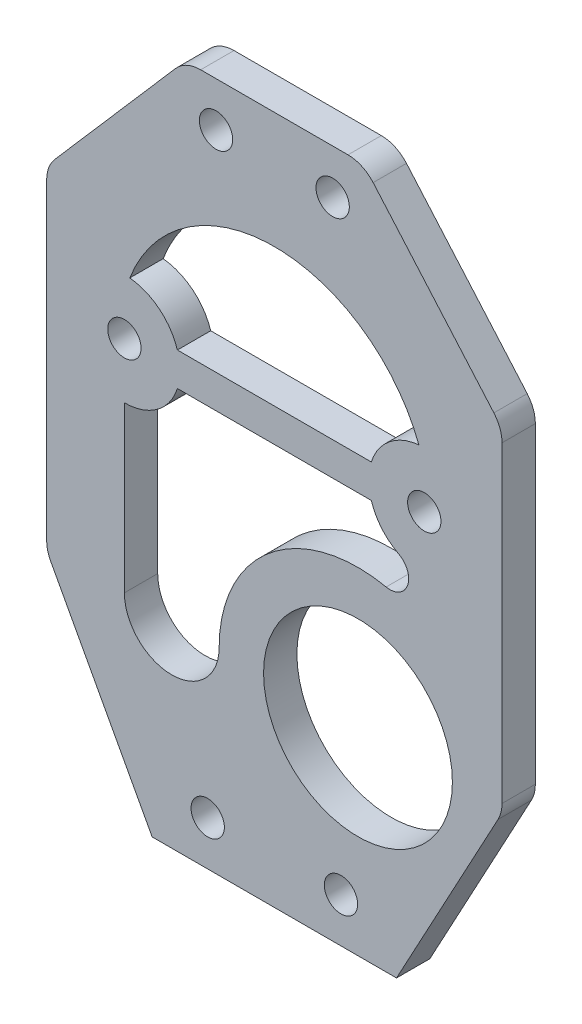
ISO-10303-21;
HEADER;
FILE_DESCRIPTION(('STEP AP214'),'2;1');
FILE_NAME('part.step','',(''),(''),'','','');
FILE_SCHEMA(('AUTOMOTIVE_DESIGN { 1 0 10303 214 1 1 1 1 }'));
ENDSEC;
DATA;
#1=APPLICATION_CONTEXT('core data for automotive mechanical design processes');
#2=APPLICATION_PROTOCOL_DEFINITION('international standard','automotive_design',2000,#1);
#3=PRODUCT_CONTEXT('',#1,'mechanical');
#4=PRODUCT('Part','Part','',(#3));
#5=PRODUCT_RELATED_PRODUCT_CATEGORY('part','',(#4));
#6=PRODUCT_DEFINITION_FORMATION('','',#4);
#7=PRODUCT_DEFINITION_CONTEXT('part definition',#1,'design');
#8=PRODUCT_DEFINITION('design','',#6,#7);
#9=PRODUCT_DEFINITION_SHAPE('','',#8);
#10=(LENGTH_UNIT() NAMED_UNIT(*) SI_UNIT(.MILLI.,.METRE.));
#11=(NAMED_UNIT(*) PLANE_ANGLE_UNIT() SI_UNIT($,.RADIAN.));
#12=(NAMED_UNIT(*) SI_UNIT($,.STERADIAN.) SOLID_ANGLE_UNIT());
#13=UNCERTAINTY_MEASURE_WITH_UNIT(LENGTH_MEASURE(1.E-05),#10,'distance_accuracy_value','');
#14=(GEOMETRIC_REPRESENTATION_CONTEXT(3) GLOBAL_UNCERTAINTY_ASSIGNED_CONTEXT((#13)) GLOBAL_UNIT_ASSIGNED_CONTEXT((#10,
#11,#12)) REPRESENTATION_CONTEXT('',''));
#15=CARTESIAN_POINT('',(0.,0.,0.));
#16=DIRECTION('',(0.,0.,1.));
#17=DIRECTION('',(1.,0.,0.));
#18=AXIS2_PLACEMENT_3D('',#15,#16,#17);
#19=CARTESIAN_POINT('',(0.,0.,1.5));
#20=DIRECTION('',(0.,0.,1.));
#21=DIRECTION('',(1.,0.,0.));
#22=AXIS2_PLACEMENT_3D('',#19,#20,#21);
#23=PLANE('',#22);
#24=DIRECTION('',(1.,0.,0.));
#25=VECTOR('',#24,1.);
#26=CARTESIAN_POINT('',(-8.73030399291527,1.5,1.5));
#27=LINE('',#26,#25);
#28=CARTESIAN_POINT('',(-8.73030399291527,1.5,1.5));
#29=VERTEX_POINT('',#28);
#30=CARTESIAN_POINT('',(8.73030399291527,1.5,1.5));
#31=VERTEX_POINT('',#30);
#32=EDGE_CURVE('E214',#29,#31,#27,.T.);
#33=ORIENTED_EDGE('',*,*,#32,.F.);
#34=CARTESIAN_POINT('',(-13.5,0.,1.5));
#35=DIRECTION('',(0.,0.,-1.));
#36=DIRECTION('',(-1.,0.,0.));
#37=AXIS2_PLACEMENT_3D('',#34,#35,#36);
#38=CIRCLE('',#37,5.);
#39=CARTESIAN_POINT('',(-13.0147345605389,4.97639603058927,1.5));
#40=VERTEX_POINT('',#39);
#41=EDGE_CURVE('E204',#40,#29,#38,.T.);
#42=ORIENTED_EDGE('',*,*,#41,.F.);
#43=CARTESIAN_POINT('',(0.,0.,1.5));
#44=DIRECTION('',(0.,0.,1.));
#45=DIRECTION('',(1.,0.,0.));
#46=AXIS2_PLACEMENT_3D('',#43,#44,#45);
#47=CIRCLE('',#46,13.9336941668228);
#48=CARTESIAN_POINT('',(13.0147345605389,4.97639603058927,1.5));
#49=VERTEX_POINT('',#48);
#50=EDGE_CURVE('E230',#49,#40,#47,.T.);
#51=ORIENTED_EDGE('',*,*,#50,.F.);
#52=CARTESIAN_POINT('',(13.5,0.,1.5));
#53=DIRECTION('',(0.,0.,-1.));
#54=DIRECTION('',(1.,0.,0.));
#55=AXIS2_PLACEMENT_3D('',#52,#53,#54);
#56=CIRCLE('',#55,5.);
#57=EDGE_CURVE('E228',#31,#49,#56,.T.);
#58=ORIENTED_EDGE('',*,*,#57,.F.);
#59=EDGE_LOOP('',(#33,#42,#51,#58));
#60=FACE_BOUND('',#59,.T.);
#61=DIRECTION('',(0.,-1.,0.));
#62=VECTOR('',#61,1.);
#63=CARTESIAN_POINT('',(-13.5,-5.,1.5));
#64=LINE('',#63,#62);
#65=CARTESIAN_POINT('',(-13.5,-5.,1.5));
#66=VERTEX_POINT('',#65);
#67=CARTESIAN_POINT('',(-13.5,-19.8174147720394,1.5));
#68=VERTEX_POINT('',#67);
#69=EDGE_CURVE('E250',#66,#68,#64,.T.);
#70=ORIENTED_EDGE('',*,*,#69,.F.);
#71=CARTESIAN_POINT('',(-13.5,0.,1.5));
#72=DIRECTION('',(0.,0.,-1.));
#73=DIRECTION('',(-1.,0.,0.));
#74=AXIS2_PLACEMENT_3D('',#71,#72,#73);
#75=CIRCLE('',#74,5.);
#76=CARTESIAN_POINT('',(-8.73030399291527,-1.5,1.5));
#77=VERTEX_POINT('',#76);
#78=EDGE_CURVE('E248',#77,#66,#75,.T.);
#79=ORIENTED_EDGE('',*,*,#78,.F.);
#80=DIRECTION('',(-1.,0.,0.));
#81=VECTOR('',#80,1.);
#82=CARTESIAN_POINT('',(-8.73030399291527,-1.5,1.5));
#83=LINE('',#82,#81);
#84=CARTESIAN_POINT('',(8.73030399291527,-1.5,1.5));
#85=VERTEX_POINT('',#84);
#86=EDGE_CURVE('E262',#85,#77,#83,.T.);
#87=ORIENTED_EDGE('',*,*,#86,.F.);
#88=CARTESIAN_POINT('',(13.5,0.,1.5));
#89=DIRECTION('',(0.,0.,-1.));
#90=DIRECTION('',(1.,0.,0.));
#91=AXIS2_PLACEMENT_3D('',#88,#89,#90);
#92=CIRCLE('',#91,5.);
#93=CARTESIAN_POINT('',(11.1879757809718,-4.43334456258783,1.5));
#94=VERTEX_POINT('',#93);
#95=EDGE_CURVE('E259',#94,#85,#92,.T.);
#96=ORIENTED_EDGE('',*,*,#95,.F.);
#97=CARTESIAN_POINT('',(10.4087781028521,-5.92746895844948,1.5));
#98=DIRECTION('',(0.,0.,1.));
#99=DIRECTION('',(1.,0.,0.));
#100=AXIS2_PLACEMENT_3D('',#97,#98,#99);
#101=CIRCLE('',#100,1.68509843388926);
#102=CARTESIAN_POINT('',(10.0668171902538,-7.57750515991626,1.5));
#103=VERTEX_POINT('',#102);
#104=EDGE_CURVE('E257',#103,#94,#101,.T.);
#105=ORIENTED_EDGE('',*,*,#104,.F.);
#106=CARTESIAN_POINT('',(7.53016335359113,-19.8174147720394,1.5));
#107=DIRECTION('',(0.,0.,-1.));
#108=DIRECTION('',(-1.,0.,0.));
#109=AXIS2_PLACEMENT_3D('',#106,#107,#108);
#110=CIRCLE('',#109,12.5);
#111=CARTESIAN_POINT('',(-4.96983664640888,-19.8174147720394,1.5));
#112=VERTEX_POINT('',#111);
#113=EDGE_CURVE('E255',#112,#103,#110,.T.);
#114=ORIENTED_EDGE('',*,*,#113,.F.);
#115=CARTESIAN_POINT('',(-9.23491832320444,-19.8174147720394,1.5));
#116=DIRECTION('',(0.,0.,1.));
#117=DIRECTION('',(1.,0.,0.));
#118=AXIS2_PLACEMENT_3D('',#115,#116,#117);
#119=CIRCLE('',#118,4.26508167679556);
#120=EDGE_CURVE('E253',#68,#112,#119,.T.);
#121=ORIENTED_EDGE('',*,*,#120,.F.);
#122=EDGE_LOOP('',(#70,#79,#87,#96,#105,#114,#121));
#123=FACE_BOUND('',#122,.T.);
#124=CARTESIAN_POINT('',(5.25,20.3945458395131,1.5));
#125=DIRECTION('',(0.,0.,1.));
#126=DIRECTION('',(-1.,0.,0.));
#127=AXIS2_PLACEMENT_3D('',#124,#125,#126);
#128=CIRCLE('',#127,1.5);
#129=CARTESIAN_POINT('',(3.75,20.3945458395131,1.5));
#130=VERTEX_POINT('',#129);
#131=EDGE_CURVE('E300',#130,#130,#128,.T.);
#132=ORIENTED_EDGE('',*,*,#131,.F.);
#133=EDGE_LOOP('',(#132));
#134=FACE_BOUND('',#133,.T.);
#135=CARTESIAN_POINT('',(6.00000000000001,-33.599715906798,1.5));
#136=DIRECTION('',(0.,0.,1.));
#137=DIRECTION('',(-1.,0.,0.));
#138=AXIS2_PLACEMENT_3D('',#135,#136,#137);
#139=CIRCLE('',#138,1.5);
#140=CARTESIAN_POINT('',(4.5,-33.599715906798,1.5));
#141=VERTEX_POINT('',#140);
#142=EDGE_CURVE('E312',#141,#141,#139,.T.);
#143=ORIENTED_EDGE('',*,*,#142,.F.);
#144=EDGE_LOOP('',(#143));
#145=FACE_BOUND('',#144,.T.);
#146=CARTESIAN_POINT('',(-5.99999999999999,-33.599715906798,1.5));
#147=DIRECTION('',(0.,0.,1.));
#148=DIRECTION('',(1.,0.,0.));
#149=AXIS2_PLACEMENT_3D('',#146,#147,#148);
#150=CIRCLE('',#149,1.5);
#151=CARTESIAN_POINT('',(-4.49999999999999,-33.599715906798,1.5));
#152=VERTEX_POINT('',#151);
#153=EDGE_CURVE('E324',#152,#152,#150,.T.);
#154=ORIENTED_EDGE('',*,*,#153,.F.);
#155=EDGE_LOOP('',(#154));
#156=FACE_BOUND('',#155,.T.);
#157=DIRECTION('',(0.,-1.,0.));
#158=VECTOR('',#157,1.);
#159=CARTESIAN_POINT('',(-20.5,10.,1.5));
#160=LINE('',#159,#158);
#161=CARTESIAN_POINT('',(-20.5,8.87956217000711,1.5));
#162=VERTEX_POINT('',#161);
#163=CARTESIAN_POINT('',(-20.5,-19.2420155495152,1.5));
#164=VERTEX_POINT('',#163);
#165=EDGE_CURVE('E350',#162,#164,#160,.T.);
#166=ORIENTED_EDGE('',*,*,#165,.T.);
#167=CARTESIAN_POINT('',(-17.5,-19.2420155495152,1.5));
#168=DIRECTION('',(0.,0.,1.));
#169=DIRECTION('',(1.,0.,0.));
#170=AXIS2_PLACEMENT_3D('',#167,#168,#169);
#171=CIRCLE('',#170,3.);
#172=CARTESIAN_POINT('',(-20.1399573860197,-20.6670155495152,1.5));
#173=VERTEX_POINT('',#172);
#174=EDGE_CURVE('E411',#164,#173,#171,.T.);
#175=ORIENTED_EDGE('',*,*,#174,.T.);
#176=DIRECTION('',(0.475,-0.879985795339902,0.));
#177=VECTOR('',#176,1.);
#178=CARTESIAN_POINT('',(-20.5,-20.,1.5));
#179=LINE('',#178,#177);
#180=CARTESIAN_POINT('',(-11.,-37.599715906798,1.5));
#181=VERTEX_POINT('',#180);
#182=EDGE_CURVE('E353',#173,#181,#179,.T.);
#183=ORIENTED_EDGE('',*,*,#182,.T.);
#184=DIRECTION('',(1.,0.,0.));
#185=VECTOR('',#184,1.);
#186=CARTESIAN_POINT('',(-11.,-37.599715906798,1.5));
#187=LINE('',#186,#185);
#188=CARTESIAN_POINT('',(11.,-37.599715906798,1.5));
#189=VERTEX_POINT('',#188);
#190=EDGE_CURVE('E355',#181,#189,#187,.T.);
#191=ORIENTED_EDGE('',*,*,#190,.T.);
#192=DIRECTION('',(0.475,0.879985795339902,0.));
#193=VECTOR('',#192,1.);
#194=CARTESIAN_POINT('',(20.5,-20.,1.5));
#195=LINE('',#194,#193);
#196=CARTESIAN_POINT('',(20.1399573860197,-20.6670155495152,1.5));
#197=VERTEX_POINT('',#196);
#198=EDGE_CURVE('E336',#189,#197,#195,.T.);
#199=ORIENTED_EDGE('',*,*,#198,.T.);
#200=CARTESIAN_POINT('',(17.5,-19.2420155495152,1.5));
#201=DIRECTION('',(0.,0.,1.));
#202=DIRECTION('',(1.,0.,0.));
#203=AXIS2_PLACEMENT_3D('',#200,#201,#202);
#204=CIRCLE('',#203,3.);
#205=CARTESIAN_POINT('',(20.5,-19.2420155495152,1.5));
#206=VERTEX_POINT('',#205);
#207=EDGE_CURVE('E409',#197,#206,#204,.T.);
#208=ORIENTED_EDGE('',*,*,#207,.T.);
#209=DIRECTION('',(0.,1.,0.));
#210=VECTOR('',#209,1.);
#211=CARTESIAN_POINT('',(20.5,10.,1.5));
#212=LINE('',#211,#210);
#213=CARTESIAN_POINT('',(20.5,8.87956217000711,1.5));
#214=VERTEX_POINT('',#213);
#215=EDGE_CURVE('E339',#206,#214,#212,.T.);
#216=ORIENTED_EDGE('',*,*,#215,.T.);
#217=CARTESIAN_POINT('',(17.5,8.87956217000711,1.5));
#218=DIRECTION('',(0.,0.,1.));
#219=DIRECTION('',(1.,0.,0.));
#220=AXIS2_PLACEMENT_3D('',#217,#218,#219);
#221=CIRCLE('',#220,3.);
#222=CARTESIAN_POINT('',(19.7655284444291,10.8461279246878,1.5));
#223=VERTEX_POINT('',#222);
#224=EDGE_CURVE('E407',#214,#223,#221,.T.);
#225=ORIENTED_EDGE('',*,*,#224,.T.);
#226=DIRECTION('',(-0.655521918226887,0.75517614814303,0.));
#227=VECTOR('',#226,1.);
#228=CARTESIAN_POINT('',(8.,24.400284093202,1.5));
#229=LINE('',#228,#227);
#230=CARTESIAN_POINT('',(8.89706064011543,23.3668498478826,1.5));
#231=VERTEX_POINT('',#230);
#232=EDGE_CURVE('E343',#223,#231,#229,.T.);
#233=ORIENTED_EDGE('',*,*,#232,.T.);
#234=CARTESIAN_POINT('',(6.63153219568634,21.400284093202,1.5));
#235=DIRECTION('',(0.,0.,1.));
#236=DIRECTION('',(1.,0.,0.));
#237=AXIS2_PLACEMENT_3D('',#234,#235,#236);
#238=CIRCLE('',#237,3.);
#239=CARTESIAN_POINT('',(6.63153219568634,24.400284093202,1.5));
#240=VERTEX_POINT('',#239);
#241=EDGE_CURVE('E405',#231,#240,#238,.T.);
#242=ORIENTED_EDGE('',*,*,#241,.T.);
#243=DIRECTION('',(-1.,0.,0.));
#244=VECTOR('',#243,1.);
#245=CARTESIAN_POINT('',(8.,24.400284093202,1.5));
#246=LINE('',#245,#244);
#247=CARTESIAN_POINT('',(-6.63153219568634,24.400284093202,1.5));
#248=VERTEX_POINT('',#247);
#249=EDGE_CURVE('E346',#240,#248,#246,.T.);
#250=ORIENTED_EDGE('',*,*,#249,.T.);
#251=CARTESIAN_POINT('',(-6.63153219568634,21.400284093202,1.5));
#252=DIRECTION('',(0.,0.,1.));
#253=DIRECTION('',(1.,0.,0.));
#254=AXIS2_PLACEMENT_3D('',#251,#252,#253);
#255=CIRCLE('',#254,3.);
#256=CARTESIAN_POINT('',(-8.89706064011543,23.3668498478826,1.5));
#257=VERTEX_POINT('',#256);
#258=EDGE_CURVE('E56',#248,#257,#255,.T.);
#259=ORIENTED_EDGE('',*,*,#258,.T.);
#260=DIRECTION('',(-0.655521918226887,-0.75517614814303,0.));
#261=VECTOR('',#260,1.);
#262=CARTESIAN_POINT('',(-8.,24.400284093202,1.5));
#263=LINE('',#262,#261);
#264=CARTESIAN_POINT('',(-19.7655284444291,10.8461279246878,1.5));
#265=VERTEX_POINT('',#264);
#266=EDGE_CURVE('E348',#257,#265,#263,.T.);
#267=ORIENTED_EDGE('',*,*,#266,.T.);
#268=CARTESIAN_POINT('',(-17.5,8.87956217000711,1.5));
#269=DIRECTION('',(0.,0.,1.));
#270=DIRECTION('',(1.,0.,0.));
#271=AXIS2_PLACEMENT_3D('',#268,#269,#270);
#272=CIRCLE('',#271,3.);
#273=EDGE_CURVE('E403',#265,#162,#272,.T.);
#274=ORIENTED_EDGE('',*,*,#273,.T.);
#275=EDGE_LOOP('',(#166,#175,#183,#191,#199,#208,#216,#225,#233,#242,#250,#259,#267,#274));
#276=FACE_BOUND('',#275,.T.);
#277=CARTESIAN_POINT('',(-13.5,0.,1.5));
#278=DIRECTION('',(0.,0.,1.));
#279=DIRECTION('',(1.,0.,0.));
#280=AXIS2_PLACEMENT_3D('',#277,#278,#279);
#281=CIRCLE('',#280,1.5);
#282=CARTESIAN_POINT('',(-12.,0.,1.5));
#283=VERTEX_POINT('',#282);
#284=EDGE_CURVE('E330',#283,#283,#281,.T.);
#285=ORIENTED_EDGE('',*,*,#284,.F.);
#286=EDGE_LOOP('',(#285));
#287=FACE_BOUND('',#286,.T.);
#288=CARTESIAN_POINT('',(-5.25,20.3945458395131,1.5));
#289=DIRECTION('',(0.,0.,1.));
#290=DIRECTION('',(1.,0.,0.));
#291=AXIS2_PLACEMENT_3D('',#288,#289,#290);
#292=CIRCLE('',#291,1.5);
#293=CARTESIAN_POINT('',(-3.75,20.3945458395131,1.5));
#294=VERTEX_POINT('',#293);
#295=EDGE_CURVE('E318',#294,#294,#292,.T.);
#296=ORIENTED_EDGE('',*,*,#295,.F.);
#297=EDGE_LOOP('',(#296));
#298=FACE_BOUND('',#297,.T.);
#299=CARTESIAN_POINT('',(13.5,0.,1.5));
#300=DIRECTION('',(0.,0.,1.));
#301=DIRECTION('',(-1.,0.,0.));
#302=AXIS2_PLACEMENT_3D('',#299,#300,#301);
#303=CIRCLE('',#302,1.5);
#304=CARTESIAN_POINT('',(12.,0.,1.5));
#305=VERTEX_POINT('',#304);
#306=EDGE_CURVE('E306',#305,#305,#303,.T.);
#307=ORIENTED_EDGE('',*,*,#306,.F.);
#308=EDGE_LOOP('',(#307));
#309=FACE_BOUND('',#308,.T.);
#310=CARTESIAN_POINT('',(7.53016335359113,-19.8174147720394,1.5));
#311=DIRECTION('',(0.,0.,1.));
#312=DIRECTION('',(1.,0.,0.));
#313=AXIS2_PLACEMENT_3D('',#310,#311,#312);
#314=CIRCLE('',#313,8.5);
#315=CARTESIAN_POINT('',(16.0301633535911,-19.8174147720394,1.5));
#316=VERTEX_POINT('',#315);
#317=EDGE_CURVE('E237',#316,#316,#314,.T.);
#318=ORIENTED_EDGE('',*,*,#317,.F.);
#319=EDGE_LOOP('',(#318));
#320=FACE_BOUND('',#319,.T.);
#321=ADVANCED_FACE('F36',(#60,#123,#134,#145,#156,#276,#287,#298,#309,#320),#23,.T.);
#322=CARTESIAN_POINT('',(0.,0.,-1.5));
#323=DIRECTION('',(0.,0.,1.));
#324=DIRECTION('',(1.,0.,0.));
#325=AXIS2_PLACEMENT_3D('',#322,#323,#324);
#326=PLANE('',#325);
#327=CARTESIAN_POINT('',(-13.5,0.,-1.5));
#328=DIRECTION('',(0.,0.,-1.));
#329=DIRECTION('',(-1.,0.,0.));
#330=AXIS2_PLACEMENT_3D('',#327,#328,#329);
#331=CIRCLE('',#330,5.);
#332=CARTESIAN_POINT('',(-8.73030399291527,-1.5,-1.5));
#333=VERTEX_POINT('',#332);
#334=CARTESIAN_POINT('',(-13.5,-5.,-1.5));
#335=VERTEX_POINT('',#334);
#336=EDGE_CURVE('E222',#333,#335,#331,.T.);
#337=ORIENTED_EDGE('',*,*,#336,.T.);
#338=DIRECTION('',(0.,-1.,0.));
#339=VECTOR('',#338,1.);
#340=CARTESIAN_POINT('',(-13.5,-5.,-1.5));
#341=LINE('',#340,#339);
#342=CARTESIAN_POINT('',(-13.5,-19.8174147720394,-1.5));
#343=VERTEX_POINT('',#342);
#344=EDGE_CURVE('E267',#335,#343,#341,.T.);
#345=ORIENTED_EDGE('',*,*,#344,.T.);
#346=CARTESIAN_POINT('',(-9.23491832320444,-19.8174147720394,-1.5));
#347=DIRECTION('',(0.,0.,1.));
#348=DIRECTION('',(1.,0.,0.));
#349=AXIS2_PLACEMENT_3D('',#346,#347,#348);
#350=CIRCLE('',#349,4.26508167679556);
#351=CARTESIAN_POINT('',(-4.96983664640888,-19.8174147720394,-1.5));
#352=VERTEX_POINT('',#351);
#353=EDGE_CURVE('E270',#343,#352,#350,.T.);
#354=ORIENTED_EDGE('',*,*,#353,.T.);
#355=CARTESIAN_POINT('',(7.53016335359113,-19.8174147720394,-1.5));
#356=DIRECTION('',(0.,0.,-1.));
#357=DIRECTION('',(-1.,0.,0.));
#358=AXIS2_PLACEMENT_3D('',#355,#356,#357);
#359=CIRCLE('',#358,12.5);
#360=CARTESIAN_POINT('',(10.0668171902538,-7.57750515991626,-1.5));
#361=VERTEX_POINT('',#360);
#362=EDGE_CURVE('E273',#352,#361,#359,.T.);
#363=ORIENTED_EDGE('',*,*,#362,.T.);
#364=CARTESIAN_POINT('',(10.4087781028521,-5.92746895844948,-1.5));
#365=DIRECTION('',(0.,0.,1.));
#366=DIRECTION('',(1.,0.,0.));
#367=AXIS2_PLACEMENT_3D('',#364,#365,#366);
#368=CIRCLE('',#367,1.68509843388926);
#369=CARTESIAN_POINT('',(11.1879757809718,-4.43334456258783,-1.5));
#370=VERTEX_POINT('',#369);
#371=EDGE_CURVE('E276',#361,#370,#368,.T.);
#372=ORIENTED_EDGE('',*,*,#371,.T.);
#373=CARTESIAN_POINT('',(13.5,0.,-1.5));
#374=DIRECTION('',(0.,0.,-1.));
#375=DIRECTION('',(1.,0.,0.));
#376=AXIS2_PLACEMENT_3D('',#373,#374,#375);
#377=CIRCLE('',#376,5.);
#378=CARTESIAN_POINT('',(8.73030399291527,-1.5,-1.5));
#379=VERTEX_POINT('',#378);
#380=EDGE_CURVE('E279',#370,#379,#377,.T.);
#381=ORIENTED_EDGE('',*,*,#380,.T.);
#382=DIRECTION('',(-1.,0.,0.));
#383=VECTOR('',#382,1.);
#384=CARTESIAN_POINT('',(-8.73030399291527,-1.5,-1.5));
#385=LINE('',#384,#383);
#386=EDGE_CURVE('E251',#379,#333,#385,.T.);
#387=ORIENTED_EDGE('',*,*,#386,.T.);
#388=EDGE_LOOP('',(#337,#345,#354,#363,#372,#381,#387));
#389=FACE_BOUND('',#388,.T.);
#390=DIRECTION('',(0.475,-0.879985795339902,0.));
#391=VECTOR('',#390,1.);
#392=CARTESIAN_POINT('',(-20.5,-20.,-1.5));
#393=LINE('',#392,#391);
#394=CARTESIAN_POINT('',(-20.1399573860197,-20.6670155495152,-1.5));
#395=VERTEX_POINT('',#394);
#396=CARTESIAN_POINT('',(-11.,-37.599715906798,-1.5));
#397=VERTEX_POINT('',#396);
#398=EDGE_CURVE('E374',#395,#397,#393,.T.);
#399=ORIENTED_EDGE('',*,*,#398,.F.);
#400=CARTESIAN_POINT('',(-17.5,-19.2420155495152,-1.5));
#401=DIRECTION('',(0.,0.,1.));
#402=DIRECTION('',(1.,0.,0.));
#403=AXIS2_PLACEMENT_3D('',#400,#401,#402);
#404=CIRCLE('',#403,3.);
#405=CARTESIAN_POINT('',(-20.5,-19.2420155495152,-1.5));
#406=VERTEX_POINT('',#405);
#407=EDGE_CURVE('E395',#395,#406,#404,.F.);
#408=ORIENTED_EDGE('',*,*,#407,.T.);
#409=DIRECTION('',(0.,-1.,0.));
#410=VECTOR('',#409,1.);
#411=CARTESIAN_POINT('',(-20.5,10.,-1.5));
#412=LINE('',#411,#410);
#413=CARTESIAN_POINT('',(-20.5,8.87956217000711,-1.5));
#414=VERTEX_POINT('',#413);
#415=EDGE_CURVE('E371',#414,#406,#412,.T.);
#416=ORIENTED_EDGE('',*,*,#415,.F.);
#417=CARTESIAN_POINT('',(-17.5,8.87956217000711,-1.5));
#418=DIRECTION('',(0.,0.,1.));
#419=DIRECTION('',(1.,0.,0.));
#420=AXIS2_PLACEMENT_3D('',#417,#418,#419);
#421=CIRCLE('',#420,3.);
#422=CARTESIAN_POINT('',(-19.7655284444291,10.8461279246878,-1.5));
#423=VERTEX_POINT('',#422);
#424=EDGE_CURVE('E387',#414,#423,#421,.F.);
#425=ORIENTED_EDGE('',*,*,#424,.T.);
#426=DIRECTION('',(-0.655521918226887,-0.75517614814303,0.));
#427=VECTOR('',#426,1.);
#428=CARTESIAN_POINT('',(-8.,24.400284093202,-1.5));
#429=LINE('',#428,#427);
#430=CARTESIAN_POINT('',(-8.89706064011543,23.3668498478826,-1.5));
#431=VERTEX_POINT('',#430);
#432=EDGE_CURVE('E369',#431,#423,#429,.T.);
#433=ORIENTED_EDGE('',*,*,#432,.F.);
#434=CARTESIAN_POINT('',(-6.63153219568634,21.400284093202,-1.5));
#435=DIRECTION('',(0.,0.,1.));
#436=DIRECTION('',(1.,0.,0.));
#437=AXIS2_PLACEMENT_3D('',#434,#435,#436);
#438=CIRCLE('',#437,3.);
#439=CARTESIAN_POINT('',(-6.63153219568634,24.400284093202,-1.5));
#440=VERTEX_POINT('',#439);
#441=EDGE_CURVE('E385',#431,#440,#438,.F.);
#442=ORIENTED_EDGE('',*,*,#441,.T.);
#443=DIRECTION('',(-1.,0.,0.));
#444=VECTOR('',#443,1.);
#445=CARTESIAN_POINT('',(8.,24.400284093202,-1.5));
#446=LINE('',#445,#444);
#447=CARTESIAN_POINT('',(6.63153219568634,24.400284093202,-1.5));
#448=VERTEX_POINT('',#447);
#449=EDGE_CURVE('E366',#448,#440,#446,.T.);
#450=ORIENTED_EDGE('',*,*,#449,.F.);
#451=CARTESIAN_POINT('',(6.63153219568634,21.400284093202,-1.5));
#452=DIRECTION('',(0.,0.,1.));
#453=DIRECTION('',(1.,0.,0.));
#454=AXIS2_PLACEMENT_3D('',#451,#452,#453);
#455=CIRCLE('',#454,3.);
#456=CARTESIAN_POINT('',(8.89706064011543,23.3668498478826,-1.5));
#457=VERTEX_POINT('',#456);
#458=EDGE_CURVE('E389',#448,#457,#455,.F.);
#459=ORIENTED_EDGE('',*,*,#458,.T.);
#460=DIRECTION('',(-0.655521918226887,0.75517614814303,0.));
#461=VECTOR('',#460,1.);
#462=CARTESIAN_POINT('',(8.,24.400284093202,-1.5));
#463=LINE('',#462,#461);
#464=CARTESIAN_POINT('',(19.7655284444291,10.8461279246878,-1.5));
#465=VERTEX_POINT('',#464);
#466=EDGE_CURVE('E363',#465,#457,#463,.T.);
#467=ORIENTED_EDGE('',*,*,#466,.F.);
#468=CARTESIAN_POINT('',(17.5,8.87956217000711,-1.5));
#469=DIRECTION('',(0.,0.,1.));
#470=DIRECTION('',(1.,0.,0.));
#471=AXIS2_PLACEMENT_3D('',#468,#469,#470);
#472=CIRCLE('',#471,3.);
#473=CARTESIAN_POINT('',(20.5,8.87956217000711,-1.5));
#474=VERTEX_POINT('',#473);
#475=EDGE_CURVE('E391',#465,#474,#472,.F.);
#476=ORIENTED_EDGE('',*,*,#475,.T.);
#477=DIRECTION('',(0.,1.,0.));
#478=VECTOR('',#477,1.);
#479=CARTESIAN_POINT('',(20.5,10.,-1.5));
#480=LINE('',#479,#478);
#481=CARTESIAN_POINT('',(20.5,-19.2420155495152,-1.5));
#482=VERTEX_POINT('',#481);
#483=EDGE_CURVE('E360',#482,#474,#480,.T.);
#484=ORIENTED_EDGE('',*,*,#483,.F.);
#485=CARTESIAN_POINT('',(17.5,-19.2420155495152,-1.5));
#486=DIRECTION('',(0.,0.,1.));
#487=DIRECTION('',(1.,0.,0.));
#488=AXIS2_PLACEMENT_3D('',#485,#486,#487);
#489=CIRCLE('',#488,3.);
#490=CARTESIAN_POINT('',(20.1399573860197,-20.6670155495152,-1.5));
#491=VERTEX_POINT('',#490);
#492=EDGE_CURVE('E393',#482,#491,#489,.F.);
#493=ORIENTED_EDGE('',*,*,#492,.T.);
#494=DIRECTION('',(0.475,0.879985795339902,0.));
#495=VECTOR('',#494,1.);
#496=CARTESIAN_POINT('',(20.5,-20.,-1.5));
#497=LINE('',#496,#495);
#498=CARTESIAN_POINT('',(11.,-37.599715906798,-1.5));
#499=VERTEX_POINT('',#498);
#500=EDGE_CURVE('E333',#499,#491,#497,.T.);
#501=ORIENTED_EDGE('',*,*,#500,.F.);
#502=DIRECTION('',(1.,0.,0.));
#503=VECTOR('',#502,1.);
#504=CARTESIAN_POINT('',(-11.,-37.599715906798,-1.5));
#505=LINE('',#504,#503);
#506=EDGE_CURVE('E340',#397,#499,#505,.T.);
#507=ORIENTED_EDGE('',*,*,#506,.F.);
#508=EDGE_LOOP('',(#399,#408,#416,#425,#433,#442,#450,#459,#467,#476,#484,#493,#501,#507));
#509=FACE_BOUND('',#508,.T.);
#510=CARTESIAN_POINT('',(-13.5,0.,-1.5));
#511=DIRECTION('',(0.,0.,1.));
#512=DIRECTION('',(1.,0.,0.));
#513=AXIS2_PLACEMENT_3D('',#510,#511,#512);
#514=CIRCLE('',#513,1.5);
#515=CARTESIAN_POINT('',(-12.,0.,-1.5));
#516=VERTEX_POINT('',#515);
#517=EDGE_CURVE('E327',#516,#516,#514,.T.);
#518=ORIENTED_EDGE('',*,*,#517,.T.);
#519=EDGE_LOOP('',(#518));
#520=FACE_BOUND('',#519,.T.);
#521=CARTESIAN_POINT('',(-5.99999999999999,-33.599715906798,-1.5));
#522=DIRECTION('',(0.,0.,1.));
#523=DIRECTION('',(1.,0.,0.));
#524=AXIS2_PLACEMENT_3D('',#521,#522,#523);
#525=CIRCLE('',#524,1.5);
#526=CARTESIAN_POINT('',(-4.49999999999999,-33.599715906798,-1.5));
#527=VERTEX_POINT('',#526);
#528=EDGE_CURVE('E321',#527,#527,#525,.T.);
#529=ORIENTED_EDGE('',*,*,#528,.T.);
#530=EDGE_LOOP('',(#529));
#531=FACE_BOUND('',#530,.T.);
#532=CARTESIAN_POINT('',(-5.25,20.3945458395131,-1.5));
#533=DIRECTION('',(0.,0.,1.));
#534=DIRECTION('',(1.,0.,0.));
#535=AXIS2_PLACEMENT_3D('',#532,#533,#534);
#536=CIRCLE('',#535,1.5);
#537=CARTESIAN_POINT('',(-3.75,20.3945458395131,-1.5));
#538=VERTEX_POINT('',#537);
#539=EDGE_CURVE('E315',#538,#538,#536,.T.);
#540=ORIENTED_EDGE('',*,*,#539,.T.);
#541=EDGE_LOOP('',(#540));
#542=FACE_BOUND('',#541,.T.);
#543=CARTESIAN_POINT('',(6.00000000000001,-33.599715906798,-1.5));
#544=DIRECTION('',(0.,0.,1.));
#545=DIRECTION('',(-1.,0.,0.));
#546=AXIS2_PLACEMENT_3D('',#543,#544,#545);
#547=CIRCLE('',#546,1.5);
#548=CARTESIAN_POINT('',(4.5,-33.599715906798,-1.5));
#549=VERTEX_POINT('',#548);
#550=EDGE_CURVE('E309',#549,#549,#547,.T.);
#551=ORIENTED_EDGE('',*,*,#550,.T.);
#552=EDGE_LOOP('',(#551));
#553=FACE_BOUND('',#552,.T.);
#554=CARTESIAN_POINT('',(13.5,0.,-1.5));
#555=DIRECTION('',(0.,0.,1.));
#556=DIRECTION('',(-1.,0.,0.));
#557=AXIS2_PLACEMENT_3D('',#554,#555,#556);
#558=CIRCLE('',#557,1.5);
#559=CARTESIAN_POINT('',(12.,0.,-1.5));
#560=VERTEX_POINT('',#559);
#561=EDGE_CURVE('E303',#560,#560,#558,.T.);
#562=ORIENTED_EDGE('',*,*,#561,.T.);
#563=EDGE_LOOP('',(#562));
#564=FACE_BOUND('',#563,.T.);
#565=CARTESIAN_POINT('',(5.25,20.3945458395131,-1.5));
#566=DIRECTION('',(0.,0.,1.));
#567=DIRECTION('',(-1.,0.,0.));
#568=AXIS2_PLACEMENT_3D('',#565,#566,#567);
#569=CIRCLE('',#568,1.5);
#570=CARTESIAN_POINT('',(3.75,20.3945458395131,-1.5));
#571=VERTEX_POINT('',#570);
#572=EDGE_CURVE('E299',#571,#571,#569,.T.);
#573=ORIENTED_EDGE('',*,*,#572,.T.);
#574=EDGE_LOOP('',(#573));
#575=FACE_BOUND('',#574,.T.);
#576=CARTESIAN_POINT('',(-13.5,0.,-1.5));
#577=DIRECTION('',(0.,0.,-1.));
#578=DIRECTION('',(-1.,0.,0.));
#579=AXIS2_PLACEMENT_3D('',#576,#577,#578);
#580=CIRCLE('',#579,5.);
#581=CARTESIAN_POINT('',(-13.0147345605389,4.97639603058927,-1.5));
#582=VERTEX_POINT('',#581);
#583=CARTESIAN_POINT('',(-8.73030399291527,1.5,-1.5));
#584=VERTEX_POINT('',#583);
#585=EDGE_CURVE('E235',#582,#584,#580,.T.);
#586=ORIENTED_EDGE('',*,*,#585,.T.);
#587=DIRECTION('',(1.,0.,0.));
#588=VECTOR('',#587,1.);
#589=CARTESIAN_POINT('',(-8.73030399291527,1.5,-1.5));
#590=LINE('',#589,#588);
#591=CARTESIAN_POINT('',(8.73030399291527,1.5,-1.5));
#592=VERTEX_POINT('',#591);
#593=EDGE_CURVE('E221',#584,#592,#590,.T.);
#594=ORIENTED_EDGE('',*,*,#593,.T.);
#595=CARTESIAN_POINT('',(13.5,0.,-1.5));
#596=DIRECTION('',(0.,0.,-1.));
#597=DIRECTION('',(1.,0.,0.));
#598=AXIS2_PLACEMENT_3D('',#595,#596,#597);
#599=CIRCLE('',#598,5.);
#600=CARTESIAN_POINT('',(13.0147345605389,4.97639603058927,-1.5));
#601=VERTEX_POINT('',#600);
#602=EDGE_CURVE('E239',#592,#601,#599,.T.);
#603=ORIENTED_EDGE('',*,*,#602,.T.);
#604=CARTESIAN_POINT('',(0.,0.,-1.5));
#605=DIRECTION('',(0.,0.,1.));
#606=DIRECTION('',(1.,0.,0.));
#607=AXIS2_PLACEMENT_3D('',#604,#605,#606);
#608=CIRCLE('',#607,13.9336941668228);
#609=EDGE_CURVE('E215',#601,#582,#608,.T.);
#610=ORIENTED_EDGE('',*,*,#609,.T.);
#611=EDGE_LOOP('',(#586,#594,#603,#610));
#612=FACE_BOUND('',#611,.T.);
#613=CARTESIAN_POINT('',(7.53016335359113,-19.8174147720394,-1.5));
#614=DIRECTION('',(0.,0.,1.));
#615=DIRECTION('',(1.,0.,0.));
#616=AXIS2_PLACEMENT_3D('',#613,#614,#615);
#617=CIRCLE('',#616,8.5);
#618=CARTESIAN_POINT('',(16.0301633535911,-19.8174147720394,-1.5));
#619=VERTEX_POINT('',#618);
#620=EDGE_CURVE('E813',#619,#619,#617,.T.);
#621=ORIENTED_EDGE('',*,*,#620,.T.);
#622=EDGE_LOOP('',(#621));
#623=FACE_BOUND('',#622,.T.);
#624=ADVANCED_FACE('F436',(#389,#509,#520,#531,#542,#553,#564,#575,#612,#623),#326,.F.);
#625=CARTESIAN_POINT('',(20.5,-20.,1.5));
#626=DIRECTION('',(-0.879985795339902,0.475,0.));
#627=DIRECTION('',(-0.475,-0.879985795339902,0.));
#628=AXIS2_PLACEMENT_3D('',#625,#626,#627);
#629=PLANE('',#628);
#630=ORIENTED_EDGE('',*,*,#500,.T.);
#631=DIRECTION('',(0.,0.,-1.));
#632=VECTOR('',#631,1.);
#633=CARTESIAN_POINT('',(20.1399573860197,-20.6670155495152,1.5));
#634=LINE('',#633,#632);
#635=EDGE_CURVE('E418',#491,#197,#634,.F.);
#636=ORIENTED_EDGE('',*,*,#635,.T.);
#637=ORIENTED_EDGE('',*,*,#198,.F.);
#638=DIRECTION('',(0.,0.,-1.));
#639=VECTOR('',#638,1.);
#640=CARTESIAN_POINT('',(11.,-37.599715906798,1.5));
#641=LINE('',#640,#639);
#642=EDGE_CURVE('E357',#189,#499,#641,.T.);
#643=ORIENTED_EDGE('',*,*,#642,.T.);
#644=EDGE_LOOP('',(#630,#636,#637,#643));
#645=FACE_BOUND('',#644,.T.);
#646=ADVANCED_FACE('F465',(#645),#629,.F.);
#647=CARTESIAN_POINT('',(20.5,10.,1.5));
#648=DIRECTION('',(-1.,0.,0.));
#649=DIRECTION('',(0.,-1.,0.));
#650=AXIS2_PLACEMENT_3D('',#647,#648,#649);
#651=PLANE('',#650);
#652=ORIENTED_EDGE('',*,*,#215,.F.);
#653=DIRECTION('',(0.,0.,-1.));
#654=VECTOR('',#653,1.);
#655=CARTESIAN_POINT('',(20.5,-19.2420155495152,1.5));
#656=LINE('',#655,#654);
#657=EDGE_CURVE('E415',#206,#482,#656,.T.);
#658=ORIENTED_EDGE('',*,*,#657,.T.);
#659=ORIENTED_EDGE('',*,*,#483,.T.);
#660=DIRECTION('',(0.,0.,-1.));
#661=VECTOR('',#660,1.);
#662=CARTESIAN_POINT('',(20.5,8.87956217000711,1.5));
#663=LINE('',#662,#661);
#664=EDGE_CURVE('E413',#474,#214,#663,.F.);
#665=ORIENTED_EDGE('',*,*,#664,.T.);
#666=EDGE_LOOP('',(#652,#658,#659,#665));
#667=FACE_BOUND('',#666,.T.);
#668=ADVANCED_FACE('F474',(#667),#651,.F.);
#669=CARTESIAN_POINT('',(8.,24.400284093202,1.5));
#670=DIRECTION('',(-0.75517614814303,-0.655521918226887,0.));
#671=DIRECTION('',(0.655521918226887,-0.75517614814303,0.));
#672=AXIS2_PLACEMENT_3D('',#669,#670,#671);
#673=PLANE('',#672);
#674=ORIENTED_EDGE('',*,*,#232,.F.);
#675=DIRECTION('',(0.,0.,-1.));
#676=VECTOR('',#675,1.);
#677=CARTESIAN_POINT('',(19.7655284444291,10.8461279246878,1.5));
#678=LINE('',#677,#676);
#679=EDGE_CURVE('E422',#223,#465,#678,.T.);
#680=ORIENTED_EDGE('',*,*,#679,.T.);
#681=ORIENTED_EDGE('',*,*,#466,.T.);
#682=DIRECTION('',(0.,0.,-1.));
#683=VECTOR('',#682,1.);
#684=CARTESIAN_POINT('',(8.89706064011543,23.3668498478826,1.5));
#685=LINE('',#684,#683);
#686=EDGE_CURVE('E420',#457,#231,#685,.F.);
#687=ORIENTED_EDGE('',*,*,#686,.T.);
#688=EDGE_LOOP('',(#674,#680,#681,#687));
#689=FACE_BOUND('',#688,.T.);
#690=ADVANCED_FACE('F483',(#689),#673,.F.);
#691=CARTESIAN_POINT('',(8.,24.400284093202,1.5));
#692=DIRECTION('',(0.,-1.,0.));
#693=DIRECTION('',(1.,0.,0.));
#694=AXIS2_PLACEMENT_3D('',#691,#692,#693);
#695=PLANE('',#694);
#696=ORIENTED_EDGE('',*,*,#249,.F.);
#697=DIRECTION('',(0.,0.,-1.));
#698=VECTOR('',#697,1.);
#699=CARTESIAN_POINT('',(6.63153219568634,24.400284093202,1.5));
#700=LINE('',#699,#698);
#701=EDGE_CURVE('E427',#240,#448,#700,.T.);
#702=ORIENTED_EDGE('',*,*,#701,.T.);
#703=ORIENTED_EDGE('',*,*,#449,.T.);
#704=DIRECTION('',(0.,0.,-1.));
#705=VECTOR('',#704,1.);
#706=CARTESIAN_POINT('',(-6.63153219568634,24.400284093202,1.5));
#707=LINE('',#706,#705);
#708=EDGE_CURVE('E425',#440,#248,#707,.F.);
#709=ORIENTED_EDGE('',*,*,#708,.T.);
#710=EDGE_LOOP('',(#696,#702,#703,#709));
#711=FACE_BOUND('',#710,.T.);
#712=ADVANCED_FACE('F491',(#711),#695,.F.);
#713=CARTESIAN_POINT('',(-8.,24.400284093202,1.5));
#714=DIRECTION('',(0.75517614814303,-0.655521918226887,0.));
#715=DIRECTION('',(0.655521918226887,0.75517614814303,0.));
#716=AXIS2_PLACEMENT_3D('',#713,#714,#715);
#717=PLANE('',#716);
#718=ORIENTED_EDGE('',*,*,#432,.T.);
#719=DIRECTION('',(0.,0.,-1.));
#720=VECTOR('',#719,1.);
#721=CARTESIAN_POINT('',(-19.7655284444291,10.8461279246878,1.5));
#722=LINE('',#721,#720);
#723=EDGE_CURVE('E11',#423,#265,#722,.F.);
#724=ORIENTED_EDGE('',*,*,#723,.T.);
#725=ORIENTED_EDGE('',*,*,#266,.F.);
#726=DIRECTION('',(0.,0.,-1.));
#727=VECTOR('',#726,1.);
#728=CARTESIAN_POINT('',(-8.89706064011543,23.3668498478826,1.5));
#729=LINE('',#728,#727);
#730=EDGE_CURVE('E44',#257,#431,#729,.T.);
#731=ORIENTED_EDGE('',*,*,#730,.T.);
#732=EDGE_LOOP('',(#718,#724,#725,#731));
#733=FACE_BOUND('',#732,.T.);
#734=ADVANCED_FACE('F432',(#733),#717,.F.);
#735=CARTESIAN_POINT('',(-20.5,10.,1.5));
#736=DIRECTION('',(1.,0.,0.));
#737=DIRECTION('',(0.,0.,-1.));
#738=AXIS2_PLACEMENT_3D('',#735,#736,#737);
#739=PLANE('',#738);
#740=ORIENTED_EDGE('',*,*,#415,.T.);
#741=DIRECTION('',(0.,0.,-1.));
#742=VECTOR('',#741,1.);
#743=CARTESIAN_POINT('',(-20.5,-19.2420155495152,1.5));
#744=LINE('',#743,#742);
#745=EDGE_CURVE('E400',#406,#164,#744,.F.);
#746=ORIENTED_EDGE('',*,*,#745,.T.);
#747=ORIENTED_EDGE('',*,*,#165,.F.);
#748=DIRECTION('',(0.,0.,-1.));
#749=VECTOR('',#748,1.);
#750=CARTESIAN_POINT('',(-20.5,8.87956217000711,1.5));
#751=LINE('',#750,#749);
#752=EDGE_CURVE('E397',#162,#414,#751,.T.);
#753=ORIENTED_EDGE('',*,*,#752,.T.);
#754=EDGE_LOOP('',(#740,#746,#747,#753));
#755=FACE_BOUND('',#754,.T.);
#756=ADVANCED_FACE('F446',(#755),#739,.F.);
#757=CARTESIAN_POINT('',(-20.5,-20.,1.5));
#758=DIRECTION('',(0.879985795339902,0.475,0.));
#759=DIRECTION('',(-0.475,0.879985795339902,0.));
#760=AXIS2_PLACEMENT_3D('',#757,#758,#759);
#761=PLANE('',#760);
#762=ORIENTED_EDGE('',*,*,#182,.F.);
#763=DIRECTION('',(0.,0.,-1.));
#764=VECTOR('',#763,1.);
#765=CARTESIAN_POINT('',(-20.1399573860197,-20.6670155495152,1.5));
#766=LINE('',#765,#764);
#767=EDGE_CURVE('E382',#173,#395,#766,.T.);
#768=ORIENTED_EDGE('',*,*,#767,.T.);
#769=ORIENTED_EDGE('',*,*,#398,.T.);
#770=DIRECTION('',(0.,0.,-1.));
#771=VECTOR('',#770,1.);
#772=CARTESIAN_POINT('',(-11.,-37.599715906798,1.5));
#773=LINE('',#772,#771);
#774=EDGE_CURVE('E379',#181,#397,#773,.T.);
#775=ORIENTED_EDGE('',*,*,#774,.F.);
#776=EDGE_LOOP('',(#762,#768,#769,#775));
#777=FACE_BOUND('',#776,.T.);
#778=ADVANCED_FACE('F455',(#777),#761,.F.);
#779=CARTESIAN_POINT('',(-11.,-37.599715906798,1.5));
#780=DIRECTION('',(0.,1.,0.));
#781=DIRECTION('',(0.,0.,1.));
#782=AXIS2_PLACEMENT_3D('',#779,#780,#781);
#783=PLANE('',#782);
#784=ORIENTED_EDGE('',*,*,#506,.T.);
#785=ORIENTED_EDGE('',*,*,#642,.F.);
#786=ORIENTED_EDGE('',*,*,#190,.F.);
#787=ORIENTED_EDGE('',*,*,#774,.T.);
#788=EDGE_LOOP('',(#784,#785,#786,#787));
#789=FACE_BOUND('',#788,.T.);
#790=ADVANCED_FACE('F461',(#789),#783,.F.);
#791=CARTESIAN_POINT('',(-13.5,0.,1.5));
#792=DIRECTION('',(0.,0.,-1.));
#793=DIRECTION('',(-1.,0.,0.));
#794=AXIS2_PLACEMENT_3D('',#791,#792,#793);
#795=CYLINDRICAL_SURFACE('',#794,1.5);
#796=ORIENTED_EDGE('',*,*,#284,.T.);
#797=EDGE_LOOP('',(#796));
#798=FACE_BOUND('',#797,.T.);
#799=ORIENTED_EDGE('',*,*,#517,.F.);
#800=EDGE_LOOP('',(#799));
#801=FACE_BOUND('',#800,.T.);
#802=ADVANCED_FACE('F505',(#798,#801),#795,.F.);
#803=CARTESIAN_POINT('',(-5.99999999999999,-33.599715906798,1.5));
#804=DIRECTION('',(0.,0.,-1.));
#805=DIRECTION('',(-1.,0.,0.));
#806=AXIS2_PLACEMENT_3D('',#803,#804,#805);
#807=CYLINDRICAL_SURFACE('',#806,1.5);
#808=ORIENTED_EDGE('',*,*,#153,.T.);
#809=EDGE_LOOP('',(#808));
#810=FACE_BOUND('',#809,.T.);
#811=ORIENTED_EDGE('',*,*,#528,.F.);
#812=EDGE_LOOP('',(#811));
#813=FACE_BOUND('',#812,.T.);
#814=ADVANCED_FACE('F702',(#810,#813),#807,.F.);
#815=CARTESIAN_POINT('',(-5.25,20.3945458395131,1.5));
#816=DIRECTION('',(0.,0.,-1.));
#817=DIRECTION('',(-1.,0.,0.));
#818=AXIS2_PLACEMENT_3D('',#815,#816,#817);
#819=CYLINDRICAL_SURFACE('',#818,1.5);
#820=ORIENTED_EDGE('',*,*,#295,.T.);
#821=EDGE_LOOP('',(#820));
#822=FACE_BOUND('',#821,.T.);
#823=ORIENTED_EDGE('',*,*,#539,.F.);
#824=EDGE_LOOP('',(#823));
#825=FACE_BOUND('',#824,.T.);
#826=ADVANCED_FACE('F693',(#822,#825),#819,.F.);
#827=CARTESIAN_POINT('',(6.00000000000001,-33.599715906798,1.5));
#828=DIRECTION('',(0.,0.,-1.));
#829=DIRECTION('',(-1.,0.,0.));
#830=AXIS2_PLACEMENT_3D('',#827,#828,#829);
#831=CYLINDRICAL_SURFACE('',#830,1.5);
#832=ORIENTED_EDGE('',*,*,#142,.T.);
#833=EDGE_LOOP('',(#832));
#834=FACE_BOUND('',#833,.T.);
#835=ORIENTED_EDGE('',*,*,#550,.F.);
#836=EDGE_LOOP('',(#835));
#837=FACE_BOUND('',#836,.T.);
#838=ADVANCED_FACE('F684',(#834,#837),#831,.F.);
#839=CARTESIAN_POINT('',(13.5,0.,1.5));
#840=DIRECTION('',(0.,0.,-1.));
#841=DIRECTION('',(-1.,0.,0.));
#842=AXIS2_PLACEMENT_3D('',#839,#840,#841);
#843=CYLINDRICAL_SURFACE('',#842,1.5);
#844=ORIENTED_EDGE('',*,*,#306,.T.);
#845=EDGE_LOOP('',(#844));
#846=FACE_BOUND('',#845,.T.);
#847=ORIENTED_EDGE('',*,*,#561,.F.);
#848=EDGE_LOOP('',(#847));
#849=FACE_BOUND('',#848,.T.);
#850=ADVANCED_FACE('F675',(#846,#849),#843,.F.);
#851=CARTESIAN_POINT('',(5.25,20.3945458395131,1.5));
#852=DIRECTION('',(0.,0.,-1.));
#853=DIRECTION('',(-1.,0.,0.));
#854=AXIS2_PLACEMENT_3D('',#851,#852,#853);
#855=CYLINDRICAL_SURFACE('',#854,1.5);
#856=ORIENTED_EDGE('',*,*,#131,.T.);
#857=EDGE_LOOP('',(#856));
#858=FACE_BOUND('',#857,.T.);
#859=ORIENTED_EDGE('',*,*,#572,.F.);
#860=EDGE_LOOP('',(#859));
#861=FACE_BOUND('',#860,.T.);
#862=ADVANCED_FACE('F666',(#858,#861),#855,.F.);
#863=CARTESIAN_POINT('',(-13.5,0.,1.5));
#864=DIRECTION('',(0.,0.,-1.));
#865=DIRECTION('',(-1.,0.,0.));
#866=AXIS2_PLACEMENT_3D('',#863,#864,#865);
#867=CYLINDRICAL_SURFACE('',#866,5.);
#868=ORIENTED_EDGE('',*,*,#336,.F.);
#869=DIRECTION('',(0.,0.,-1.));
#870=VECTOR('',#869,1.);
#871=CARTESIAN_POINT('',(-8.73030399291527,-1.5,1.5));
#872=LINE('',#871,#870);
#873=EDGE_CURVE('E264',#77,#333,#872,.T.);
#874=ORIENTED_EDGE('',*,*,#873,.F.);
#875=ORIENTED_EDGE('',*,*,#78,.T.);
#876=DIRECTION('',(0.,0.,-1.));
#877=VECTOR('',#876,1.);
#878=CARTESIAN_POINT('',(-13.5,-5.,1.5));
#879=LINE('',#878,#877);
#880=EDGE_CURVE('E296',#66,#335,#879,.T.);
#881=ORIENTED_EDGE('',*,*,#880,.T.);
#882=EDGE_LOOP('',(#868,#874,#875,#881));
#883=FACE_BOUND('',#882,.T.);
#884=ADVANCED_FACE('F657',(#883),#867,.T.);
#885=CARTESIAN_POINT('',(-13.5,-5.,1.5));
#886=DIRECTION('',(1.,0.,0.));
#887=DIRECTION('',(0.,1.,0.));
#888=AXIS2_PLACEMENT_3D('',#885,#886,#887);
#889=PLANE('',#888);
#890=ORIENTED_EDGE('',*,*,#344,.F.);
#891=ORIENTED_EDGE('',*,*,#880,.F.);
#892=ORIENTED_EDGE('',*,*,#69,.T.);
#893=DIRECTION('',(0.,0.,-1.));
#894=VECTOR('',#893,1.);
#895=CARTESIAN_POINT('',(-13.5,-19.8174147720394,1.5));
#896=LINE('',#895,#894);
#897=EDGE_CURVE('E294',#68,#343,#896,.T.);
#898=ORIENTED_EDGE('',*,*,#897,.T.);
#899=EDGE_LOOP('',(#890,#891,#892,#898));
#900=FACE_BOUND('',#899,.T.);
#901=ADVANCED_FACE('F648',(#900),#889,.T.);
#902=CARTESIAN_POINT('',(-9.23491832320444,-19.8174147720394,1.5));
#903=DIRECTION('',(0.,0.,-1.));
#904=DIRECTION('',(-1.,0.,0.));
#905=AXIS2_PLACEMENT_3D('',#902,#903,#904);
#906=CYLINDRICAL_SURFACE('',#905,4.26508167679556);
#907=ORIENTED_EDGE('',*,*,#353,.F.);
#908=ORIENTED_EDGE('',*,*,#897,.F.);
#909=ORIENTED_EDGE('',*,*,#120,.T.);
#910=DIRECTION('',(0.,0.,-1.));
#911=VECTOR('',#910,1.);
#912=CARTESIAN_POINT('',(-4.96983664640888,-19.8174147720394,1.5));
#913=LINE('',#912,#911);
#914=EDGE_CURVE('E292',#112,#352,#913,.T.);
#915=ORIENTED_EDGE('',*,*,#914,.T.);
#916=EDGE_LOOP('',(#907,#908,#909,#915));
#917=FACE_BOUND('',#916,.T.);
#918=ADVANCED_FACE('F639',(#917),#906,.F.);
#919=CARTESIAN_POINT('',(7.53016335359113,-19.8174147720394,1.5));
#920=DIRECTION('',(0.,0.,-1.));
#921=DIRECTION('',(-1.,0.,0.));
#922=AXIS2_PLACEMENT_3D('',#919,#920,#921);
#923=CYLINDRICAL_SURFACE('',#922,12.5);
#924=ORIENTED_EDGE('',*,*,#362,.F.);
#925=ORIENTED_EDGE('',*,*,#914,.F.);
#926=ORIENTED_EDGE('',*,*,#113,.T.);
#927=DIRECTION('',(0.,0.,-1.));
#928=VECTOR('',#927,1.);
#929=CARTESIAN_POINT('',(10.0668171902538,-7.57750515991626,1.5));
#930=LINE('',#929,#928);
#931=EDGE_CURVE('E290',#103,#361,#930,.T.);
#932=ORIENTED_EDGE('',*,*,#931,.T.);
#933=EDGE_LOOP('',(#924,#925,#926,#932));
#934=FACE_BOUND('',#933,.T.);
#935=ADVANCED_FACE('F630',(#934),#923,.T.);
#936=CARTESIAN_POINT('',(10.4087781028521,-5.92746895844948,1.5));
#937=DIRECTION('',(0.,0.,-1.));
#938=DIRECTION('',(-1.,0.,0.));
#939=AXIS2_PLACEMENT_3D('',#936,#937,#938);
#940=CYLINDRICAL_SURFACE('',#939,1.68509843388926);
#941=ORIENTED_EDGE('',*,*,#371,.F.);
#942=ORIENTED_EDGE('',*,*,#931,.F.);
#943=ORIENTED_EDGE('',*,*,#104,.T.);
#944=DIRECTION('',(0.,0.,-1.));
#945=VECTOR('',#944,1.);
#946=CARTESIAN_POINT('',(11.1879757809718,-4.43334456258783,1.5));
#947=LINE('',#946,#945);
#948=EDGE_CURVE('E288',#94,#370,#947,.T.);
#949=ORIENTED_EDGE('',*,*,#948,.T.);
#950=EDGE_LOOP('',(#941,#942,#943,#949));
#951=FACE_BOUND('',#950,.T.);
#952=ADVANCED_FACE('F621',(#951),#940,.F.);
#953=CARTESIAN_POINT('',(13.5,0.,1.5));
#954=DIRECTION('',(0.,0.,-1.));
#955=DIRECTION('',(-1.,0.,0.));
#956=AXIS2_PLACEMENT_3D('',#953,#954,#955);
#957=CYLINDRICAL_SURFACE('',#956,5.);
#958=ORIENTED_EDGE('',*,*,#380,.F.);
#959=ORIENTED_EDGE('',*,*,#948,.F.);
#960=ORIENTED_EDGE('',*,*,#95,.T.);
#961=DIRECTION('',(0.,0.,-1.));
#962=VECTOR('',#961,1.);
#963=CARTESIAN_POINT('',(8.73030399291527,-1.5,1.5));
#964=LINE('',#963,#962);
#965=EDGE_CURVE('E286',#85,#379,#964,.T.);
#966=ORIENTED_EDGE('',*,*,#965,.T.);
#967=EDGE_LOOP('',(#958,#959,#960,#966));
#968=FACE_BOUND('',#967,.T.);
#969=ADVANCED_FACE('F612',(#968),#957,.T.);
#970=CARTESIAN_POINT('',(-8.73030399291527,-1.5,1.5));
#971=DIRECTION('',(0.,-1.,0.));
#972=DIRECTION('',(0.,0.,-1.));
#973=AXIS2_PLACEMENT_3D('',#970,#971,#972);
#974=PLANE('',#973);
#975=ORIENTED_EDGE('',*,*,#386,.F.);
#976=ORIENTED_EDGE('',*,*,#965,.F.);
#977=ORIENTED_EDGE('',*,*,#86,.T.);
#978=ORIENTED_EDGE('',*,*,#873,.T.);
#979=EDGE_LOOP('',(#975,#976,#977,#978));
#980=FACE_BOUND('',#979,.T.);
#981=ADVANCED_FACE('F604',(#980),#974,.T.);
#982=CARTESIAN_POINT('',(-13.5,0.,1.5));
#983=DIRECTION('',(0.,0.,-1.));
#984=DIRECTION('',(-1.,0.,0.));
#985=AXIS2_PLACEMENT_3D('',#982,#983,#984);
#986=CYLINDRICAL_SURFACE('',#985,5.);
#987=ORIENTED_EDGE('',*,*,#585,.F.);
#988=DIRECTION('',(0.,0.,-1.));
#989=VECTOR('',#988,1.);
#990=CARTESIAN_POINT('',(-13.0147345605389,4.97639603058927,1.5));
#991=LINE('',#990,#989);
#992=EDGE_CURVE('E210',#40,#582,#991,.T.);
#993=ORIENTED_EDGE('',*,*,#992,.F.);
#994=ORIENTED_EDGE('',*,*,#41,.T.);
#995=DIRECTION('',(0.,0.,-1.));
#996=VECTOR('',#995,1.);
#997=CARTESIAN_POINT('',(-8.73030399291527,1.5,1.5));
#998=LINE('',#997,#996);
#999=EDGE_CURVE('E207',#29,#584,#998,.T.);
#1000=ORIENTED_EDGE('',*,*,#999,.T.);
#1001=EDGE_LOOP('',(#987,#993,#994,#1000));
#1002=FACE_BOUND('',#1001,.T.);
#1003=ADVANCED_FACE('F206',(#1002),#986,.T.);
#1004=CARTESIAN_POINT('',(-8.73030399291527,1.5,1.5));
#1005=DIRECTION('',(0.,1.,0.));
#1006=DIRECTION('',(0.,0.,1.));
#1007=AXIS2_PLACEMENT_3D('',#1004,#1005,#1006);
#1008=PLANE('',#1007);
#1009=ORIENTED_EDGE('',*,*,#593,.F.);
#1010=ORIENTED_EDGE('',*,*,#999,.F.);
#1011=ORIENTED_EDGE('',*,*,#32,.T.);
#1012=DIRECTION('',(0.,0.,-1.));
#1013=VECTOR('',#1012,1.);
#1014=CARTESIAN_POINT('',(8.73030399291527,1.5,1.5));
#1015=LINE('',#1014,#1013);
#1016=EDGE_CURVE('E223',#31,#592,#1015,.T.);
#1017=ORIENTED_EDGE('',*,*,#1016,.T.);
#1018=EDGE_LOOP('',(#1009,#1010,#1011,#1017));
#1019=FACE_BOUND('',#1018,.T.);
#1020=ADVANCED_FACE('F218',(#1019),#1008,.T.);
#1021=CARTESIAN_POINT('',(13.5,0.,1.5));
#1022=DIRECTION('',(0.,0.,-1.));
#1023=DIRECTION('',(-1.,0.,0.));
#1024=AXIS2_PLACEMENT_3D('',#1021,#1022,#1023);
#1025=CYLINDRICAL_SURFACE('',#1024,5.);
#1026=ORIENTED_EDGE('',*,*,#602,.F.);
#1027=ORIENTED_EDGE('',*,*,#1016,.F.);
#1028=ORIENTED_EDGE('',*,*,#57,.T.);
#1029=DIRECTION('',(0.,0.,-1.));
#1030=VECTOR('',#1029,1.);
#1031=CARTESIAN_POINT('',(13.0147345605389,4.97639603058927,1.5));
#1032=LINE('',#1031,#1030);
#1033=EDGE_CURVE('E245',#49,#601,#1032,.T.);
#1034=ORIENTED_EDGE('',*,*,#1033,.T.);
#1035=EDGE_LOOP('',(#1026,#1027,#1028,#1034));
#1036=FACE_BOUND('',#1035,.T.);
#1037=ADVANCED_FACE('F580',(#1036),#1025,.T.);
#1038=CARTESIAN_POINT('',(0.,0.,1.5));
#1039=DIRECTION('',(0.,0.,-1.));
#1040=DIRECTION('',(-1.,0.,0.));
#1041=AXIS2_PLACEMENT_3D('',#1038,#1039,#1040);
#1042=CYLINDRICAL_SURFACE('',#1041,13.9336941668228);
#1043=ORIENTED_EDGE('',*,*,#609,.F.);
#1044=ORIENTED_EDGE('',*,*,#1033,.F.);
#1045=ORIENTED_EDGE('',*,*,#50,.T.);
#1046=ORIENTED_EDGE('',*,*,#992,.T.);
#1047=EDGE_LOOP('',(#1043,#1044,#1045,#1046));
#1048=FACE_BOUND('',#1047,.T.);
#1049=ADVANCED_FACE('F571',(#1048),#1042,.F.);
#1050=CARTESIAN_POINT('',(7.53016335359113,-19.8174147720394,1.5));
#1051=DIRECTION('',(0.,0.,-1.));
#1052=DIRECTION('',(-1.,0.,0.));
#1053=AXIS2_PLACEMENT_3D('',#1050,#1051,#1052);
#1054=CYLINDRICAL_SURFACE('',#1053,8.5);
#1055=ORIENTED_EDGE('',*,*,#317,.T.);
#1056=EDGE_LOOP('',(#1055));
#1057=FACE_BOUND('',#1056,.T.);
#1058=ORIENTED_EDGE('',*,*,#620,.F.);
#1059=EDGE_LOOP('',(#1058));
#1060=FACE_BOUND('',#1059,.T.);
#1061=ADVANCED_FACE('F526',(#1057,#1060),#1054,.F.);
#1062=CARTESIAN_POINT('',(-17.5,-19.2420155495152,1.5));
#1063=DIRECTION('',(0.,0.,-1.));
#1064=DIRECTION('',(-1.,0.,0.));
#1065=AXIS2_PLACEMENT_3D('',#1062,#1063,#1064);
#1066=CYLINDRICAL_SURFACE('',#1065,3.);
#1067=ORIENTED_EDGE('',*,*,#174,.F.);
#1068=ORIENTED_EDGE('',*,*,#745,.F.);
#1069=ORIENTED_EDGE('',*,*,#407,.F.);
#1070=ORIENTED_EDGE('',*,*,#767,.F.);
#1071=EDGE_LOOP('',(#1067,#1068,#1069,#1070));
#1072=FACE_BOUND('',#1071,.T.);
#1073=ADVANCED_FACE('F453',(#1072),#1066,.T.);
#1074=CARTESIAN_POINT('',(17.5,-19.2420155495152,1.5));
#1075=DIRECTION('',(0.,0.,-1.));
#1076=DIRECTION('',(-1.,0.,0.));
#1077=AXIS2_PLACEMENT_3D('',#1074,#1075,#1076);
#1078=CYLINDRICAL_SURFACE('',#1077,3.);
#1079=ORIENTED_EDGE('',*,*,#207,.F.);
#1080=ORIENTED_EDGE('',*,*,#635,.F.);
#1081=ORIENTED_EDGE('',*,*,#492,.F.);
#1082=ORIENTED_EDGE('',*,*,#657,.F.);
#1083=EDGE_LOOP('',(#1079,#1080,#1081,#1082));
#1084=FACE_BOUND('',#1083,.T.);
#1085=ADVANCED_FACE('F471',(#1084),#1078,.T.);
#1086=CARTESIAN_POINT('',(17.5,8.87956217000711,1.5));
#1087=DIRECTION('',(0.,0.,-1.));
#1088=DIRECTION('',(-1.,0.,0.));
#1089=AXIS2_PLACEMENT_3D('',#1086,#1087,#1088);
#1090=CYLINDRICAL_SURFACE('',#1089,3.);
#1091=ORIENTED_EDGE('',*,*,#224,.F.);
#1092=ORIENTED_EDGE('',*,*,#664,.F.);
#1093=ORIENTED_EDGE('',*,*,#475,.F.);
#1094=ORIENTED_EDGE('',*,*,#679,.F.);
#1095=EDGE_LOOP('',(#1091,#1092,#1093,#1094));
#1096=FACE_BOUND('',#1095,.T.);
#1097=ADVANCED_FACE('F480',(#1096),#1090,.T.);
#1098=CARTESIAN_POINT('',(6.63153219568634,21.400284093202,1.5));
#1099=DIRECTION('',(0.,0.,-1.));
#1100=DIRECTION('',(-1.,0.,0.));
#1101=AXIS2_PLACEMENT_3D('',#1098,#1099,#1100);
#1102=CYLINDRICAL_SURFACE('',#1101,3.);
#1103=ORIENTED_EDGE('',*,*,#241,.F.);
#1104=ORIENTED_EDGE('',*,*,#686,.F.);
#1105=ORIENTED_EDGE('',*,*,#458,.F.);
#1106=ORIENTED_EDGE('',*,*,#701,.F.);
#1107=EDGE_LOOP('',(#1103,#1104,#1105,#1106));
#1108=FACE_BOUND('',#1107,.T.);
#1109=ADVANCED_FACE('F489',(#1108),#1102,.T.);
#1110=CARTESIAN_POINT('',(-17.5,8.87956217000711,1.5));
#1111=DIRECTION('',(0.,0.,-1.));
#1112=DIRECTION('',(-1.,0.,0.));
#1113=AXIS2_PLACEMENT_3D('',#1110,#1111,#1112);
#1114=CYLINDRICAL_SURFACE('',#1113,3.);
#1115=ORIENTED_EDGE('',*,*,#273,.F.);
#1116=ORIENTED_EDGE('',*,*,#723,.F.);
#1117=ORIENTED_EDGE('',*,*,#424,.F.);
#1118=ORIENTED_EDGE('',*,*,#752,.F.);
#1119=EDGE_LOOP('',(#1115,#1116,#1117,#1118));
#1120=FACE_BOUND('',#1119,.T.);
#1121=ADVANCED_FACE('F443',(#1120),#1114,.T.);
#1122=CARTESIAN_POINT('',(-6.63153219568634,21.400284093202,1.5));
#1123=DIRECTION('',(0.,0.,-1.));
#1124=DIRECTION('',(-1.,0.,0.));
#1125=AXIS2_PLACEMENT_3D('',#1122,#1123,#1124);
#1126=CYLINDRICAL_SURFACE('',#1125,3.);
#1127=ORIENTED_EDGE('',*,*,#258,.F.);
#1128=ORIENTED_EDGE('',*,*,#708,.F.);
#1129=ORIENTED_EDGE('',*,*,#441,.F.);
#1130=ORIENTED_EDGE('',*,*,#730,.F.);
#1131=EDGE_LOOP('',(#1127,#1128,#1129,#1130));
#1132=FACE_BOUND('',#1131,.T.);
#1133=ADVANCED_FACE('F38',(#1132),#1126,.T.);
#1134=CLOSED_SHELL('',(#321,#624,#646,#668,#690,#712,#734,#756,#778,#790,#802,#814,#826,#838,
#850,#862,#884,#901,#918,#935,#952,#969,#981,#1003,#1020,#1037,#1049,#1061,#1073,#1085,#1097,
#1109,#1121,#1133));
#1135=MANIFOLD_SOLID_BREP('B2',#1134);
#1136=ADVANCED_BREP_SHAPE_REPRESENTATION('',(#18,#1135),#14);
#1137=SHAPE_DEFINITION_REPRESENTATION(#9,#1136);
ENDSEC;
END-ISO-10303-21;
